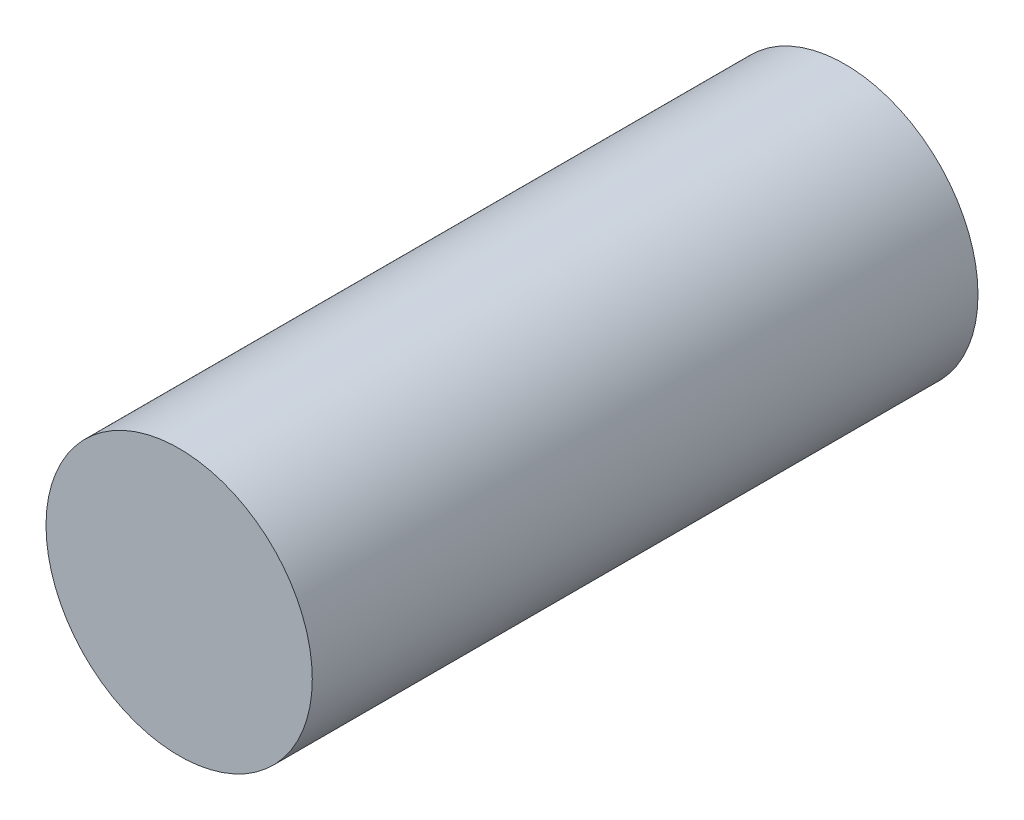
ISO-10303-21;
HEADER;
FILE_DESCRIPTION(('STEP AP214'),'2;1');
FILE_NAME('part.step','',(''),(''),'','','');
FILE_SCHEMA(('AUTOMOTIVE_DESIGN { 1 0 10303 214 1 1 1 1 }'));
ENDSEC;
DATA;
#1=APPLICATION_CONTEXT('core data for automotive mechanical design processes');
#2=APPLICATION_PROTOCOL_DEFINITION('international standard','automotive_design',2000,#1);
#3=PRODUCT_CONTEXT('',#1,'mechanical');
#4=PRODUCT('Part','Part','',(#3));
#5=PRODUCT_RELATED_PRODUCT_CATEGORY('part','',(#4));
#6=PRODUCT_DEFINITION_FORMATION('','',#4);
#7=PRODUCT_DEFINITION_CONTEXT('part definition',#1,'design');
#8=PRODUCT_DEFINITION('design','',#6,#7);
#9=PRODUCT_DEFINITION_SHAPE('','',#8);
#10=(LENGTH_UNIT() NAMED_UNIT(*) SI_UNIT(.MILLI.,.METRE.));
#11=(NAMED_UNIT(*) PLANE_ANGLE_UNIT() SI_UNIT($,.RADIAN.));
#12=(NAMED_UNIT(*) SI_UNIT($,.STERADIAN.) SOLID_ANGLE_UNIT());
#13=UNCERTAINTY_MEASURE_WITH_UNIT(LENGTH_MEASURE(1.E-05),#10,'distance_accuracy_value','');
#14=(GEOMETRIC_REPRESENTATION_CONTEXT(3) GLOBAL_UNCERTAINTY_ASSIGNED_CONTEXT((#13)) GLOBAL_UNIT_ASSIGNED_CONTEXT((#10,
#11,#12)) REPRESENTATION_CONTEXT('',''));
#15=CARTESIAN_POINT('',(0.,0.,0.));
#16=DIRECTION('',(0.,0.,1.));
#17=DIRECTION('',(1.,0.,0.));
#18=AXIS2_PLACEMENT_3D('',#15,#16,#17);
#19=CARTESIAN_POINT('',(0.,0.,1.));
#20=DIRECTION('',(0.,0.,-1.));
#21=DIRECTION('',(-1.,0.,0.));
#22=AXIS2_PLACEMENT_3D('',#19,#20,#21);
#23=CYLINDRICAL_SURFACE('',#22,0.2);
#24=CARTESIAN_POINT('',(0.,0.,1.));
#25=DIRECTION('',(0.,0.,1.));
#26=DIRECTION('',(1.,0.,0.));
#27=AXIS2_PLACEMENT_3D('',#24,#25,#26);
#28=CIRCLE('',#27,0.2);
#29=CARTESIAN_POINT('',(0.2,0.,1.));
#30=VERTEX_POINT('',#29);
#31=EDGE_CURVE('E10',#30,#30,#28,.T.);
#32=ORIENTED_EDGE('',*,*,#31,.F.);
#33=EDGE_LOOP('',(#32));
#34=FACE_BOUND('',#33,.T.);
#35=CARTESIAN_POINT('',(0.,0.,0.));
#36=DIRECTION('',(0.,0.,1.));
#37=DIRECTION('',(1.,0.,0.));
#38=AXIS2_PLACEMENT_3D('',#35,#36,#37);
#39=CIRCLE('',#38,0.2);
#40=CARTESIAN_POINT('',(0.2,0.,0.));
#41=VERTEX_POINT('',#40);
#42=EDGE_CURVE('E34',#41,#41,#39,.T.);
#43=ORIENTED_EDGE('',*,*,#42,.T.);
#44=EDGE_LOOP('',(#43));
#45=FACE_BOUND('',#44,.T.);
#46=ADVANCED_FACE('F31',(#34,#45),#23,.T.);
#47=CARTESIAN_POINT('',(0.,0.,1.));
#48=DIRECTION('',(0.,0.,1.));
#49=DIRECTION('',(1.,0.,0.));
#50=AXIS2_PLACEMENT_3D('',#47,#48,#49);
#51=PLANE('',#50);
#52=ORIENTED_EDGE('',*,*,#31,.T.);
#53=EDGE_LOOP('',(#52));
#54=FACE_BOUND('',#53,.T.);
#55=ADVANCED_FACE('F46',(#54),#51,.T.);
#56=CARTESIAN_POINT('',(0.,0.,0.));
#57=DIRECTION('',(0.,0.,1.));
#58=DIRECTION('',(1.,0.,0.));
#59=AXIS2_PLACEMENT_3D('',#56,#57,#58);
#60=PLANE('',#59);
#61=ORIENTED_EDGE('',*,*,#42,.F.);
#62=EDGE_LOOP('',(#61));
#63=FACE_BOUND('',#62,.T.);
#64=ADVANCED_FACE('F44',(#63),#60,.F.);
#65=CLOSED_SHELL('',(#46,#55,#64));
#66=MANIFOLD_SOLID_BREP('B2',#65);
#67=ADVANCED_BREP_SHAPE_REPRESENTATION('',(#18,#66),#14);
#68=SHAPE_DEFINITION_REPRESENTATION(#9,#67);
ENDSEC;
END-ISO-10303-21;
